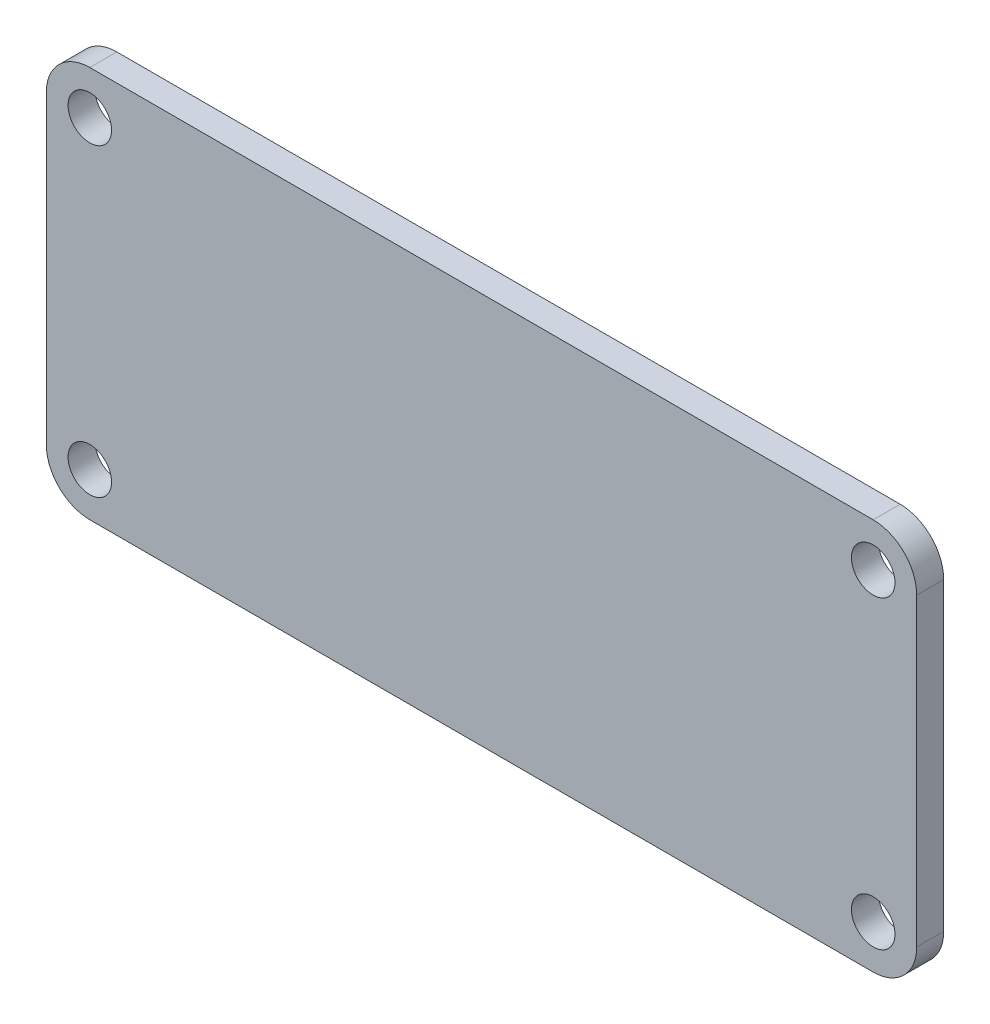
ISO-10303-21;
HEADER;
FILE_DESCRIPTION(('STEP AP214'),'2;1');
FILE_NAME('part.step','',(''),(''),'','','');
FILE_SCHEMA(('AUTOMOTIVE_DESIGN { 1 0 10303 214 1 1 1 1 }'));
ENDSEC;
DATA;
#1=APPLICATION_CONTEXT('core data for automotive mechanical design processes');
#2=APPLICATION_PROTOCOL_DEFINITION('international standard','automotive_design',2000,#1);
#3=PRODUCT_CONTEXT('',#1,'mechanical');
#4=PRODUCT('Part','Part','',(#3));
#5=PRODUCT_RELATED_PRODUCT_CATEGORY('part','',(#4));
#6=PRODUCT_DEFINITION_FORMATION('','',#4);
#7=PRODUCT_DEFINITION_CONTEXT('part definition',#1,'design');
#8=PRODUCT_DEFINITION('design','',#6,#7);
#9=PRODUCT_DEFINITION_SHAPE('','',#8);
#10=(LENGTH_UNIT() NAMED_UNIT(*) SI_UNIT(.MILLI.,.METRE.));
#11=(NAMED_UNIT(*) PLANE_ANGLE_UNIT() SI_UNIT($,.RADIAN.));
#12=(NAMED_UNIT(*) SI_UNIT($,.STERADIAN.) SOLID_ANGLE_UNIT());
#13=UNCERTAINTY_MEASURE_WITH_UNIT(LENGTH_MEASURE(1.E-05),#10,'distance_accuracy_value','');
#14=(GEOMETRIC_REPRESENTATION_CONTEXT(3) GLOBAL_UNCERTAINTY_ASSIGNED_CONTEXT((#13)) GLOBAL_UNIT_ASSIGNED_CONTEXT((#10,
#11,#12)) REPRESENTATION_CONTEXT('',''));
#15=CARTESIAN_POINT('',(0.,0.,0.));
#16=DIRECTION('',(0.,0.,1.));
#17=DIRECTION('',(1.,0.,0.));
#18=AXIS2_PLACEMENT_3D('',#15,#16,#17);
#19=CARTESIAN_POINT('',(-25.4,-11.43,1.5748));
#20=DIRECTION('',(1.,0.,0.));
#21=DIRECTION('',(0.,0.,-1.));
#22=AXIS2_PLACEMENT_3D('',#19,#20,#21);
#23=PLANE('',#22);
#24=DIRECTION('',(0.,-1.,0.));
#25=VECTOR('',#24,1.);
#26=CARTESIAN_POINT('',(-25.4,-11.43,0.));
#27=LINE('',#26,#25);
#28=CARTESIAN_POINT('',(-25.4,8.89,0.));
#29=VERTEX_POINT('',#28);
#30=CARTESIAN_POINT('',(-25.4,-8.89,0.));
#31=VERTEX_POINT('',#30);
#32=EDGE_CURVE('E158',#29,#31,#27,.T.);
#33=ORIENTED_EDGE('',*,*,#32,.T.);
#34=DIRECTION('',(0.,0.,-1.));
#35=VECTOR('',#34,1.);
#36=CARTESIAN_POINT('',(-25.4,-8.89,1.5748));
#37=LINE('',#36,#35);
#38=CARTESIAN_POINT('',(-25.4,-8.89,1.5748));
#39=VERTEX_POINT('',#38);
#40=EDGE_CURVE('E11',#31,#39,#37,.F.);
#41=ORIENTED_EDGE('',*,*,#40,.T.);
#42=DIRECTION('',(0.,-1.,0.));
#43=VECTOR('',#42,1.);
#44=CARTESIAN_POINT('',(-25.4,-11.43,1.5748));
#45=LINE('',#44,#43);
#46=CARTESIAN_POINT('',(-25.4,8.89,1.5748));
#47=VERTEX_POINT('',#46);
#48=EDGE_CURVE('E126',#47,#39,#45,.T.);
#49=ORIENTED_EDGE('',*,*,#48,.F.);
#50=DIRECTION('',(0.,0.,-1.));
#51=VECTOR('',#50,1.);
#52=CARTESIAN_POINT('',(-25.4,8.89,1.5748));
#53=LINE('',#52,#51);
#54=EDGE_CURVE('E42',#47,#29,#53,.T.);
#55=ORIENTED_EDGE('',*,*,#54,.T.);
#56=EDGE_LOOP('',(#33,#41,#49,#55));
#57=FACE_BOUND('',#56,.T.);
#58=ADVANCED_FACE('F34',(#57),#23,.F.);
#59=CARTESIAN_POINT('',(25.4,-11.43,1.5748));
#60=DIRECTION('',(0.,1.,0.));
#61=DIRECTION('',(-1.,0.,0.));
#62=AXIS2_PLACEMENT_3D('',#59,#60,#61);
#63=PLANE('',#62);
#64=DIRECTION('',(1.,0.,0.));
#65=VECTOR('',#64,1.);
#66=CARTESIAN_POINT('',(25.4,-11.43,0.));
#67=LINE('',#66,#65);
#68=CARTESIAN_POINT('',(-22.86,-11.43,0.));
#69=VERTEX_POINT('',#68);
#70=CARTESIAN_POINT('',(22.86,-11.43,0.));
#71=VERTEX_POINT('',#70);
#72=EDGE_CURVE('E131',#69,#71,#67,.T.);
#73=ORIENTED_EDGE('',*,*,#72,.T.);
#74=DIRECTION('',(0.,0.,-1.));
#75=VECTOR('',#74,1.);
#76=CARTESIAN_POINT('',(22.86,-11.43,1.5748));
#77=LINE('',#76,#75);
#78=CARTESIAN_POINT('',(22.86,-11.43,1.5748));
#79=VERTEX_POINT('',#78);
#80=EDGE_CURVE('E49',#71,#79,#77,.F.);
#81=ORIENTED_EDGE('',*,*,#80,.T.);
#82=DIRECTION('',(1.,0.,0.));
#83=VECTOR('',#82,1.);
#84=CARTESIAN_POINT('',(25.4,-11.43,1.5748));
#85=LINE('',#84,#83);
#86=CARTESIAN_POINT('',(-22.86,-11.43,1.5748));
#87=VERTEX_POINT('',#86);
#88=EDGE_CURVE('E129',#87,#79,#85,.T.);
#89=ORIENTED_EDGE('',*,*,#88,.F.);
#90=DIRECTION('',(0.,0.,-1.));
#91=VECTOR('',#90,1.);
#92=CARTESIAN_POINT('',(-22.86,-11.43,1.5748));
#93=LINE('',#92,#91);
#94=EDGE_CURVE('E150',#87,#69,#93,.T.);
#95=ORIENTED_EDGE('',*,*,#94,.T.);
#96=EDGE_LOOP('',(#73,#81,#89,#95));
#97=FACE_BOUND('',#96,.T.);
#98=ADVANCED_FACE('F218',(#97),#63,.F.);
#99=CARTESIAN_POINT('',(25.4,-11.43,1.5748));
#100=DIRECTION('',(-1.,0.,0.));
#101=DIRECTION('',(0.,0.,1.));
#102=AXIS2_PLACEMENT_3D('',#99,#100,#101);
#103=PLANE('',#102);
#104=DIRECTION('',(0.,1.,0.));
#105=VECTOR('',#104,1.);
#106=CARTESIAN_POINT('',(25.4,-11.43,0.));
#107=LINE('',#106,#105);
#108=CARTESIAN_POINT('',(25.4,-8.89,0.));
#109=VERTEX_POINT('',#108);
#110=CARTESIAN_POINT('',(25.4,8.89,0.));
#111=VERTEX_POINT('',#110);
#112=EDGE_CURVE('E127',#109,#111,#107,.T.);
#113=ORIENTED_EDGE('',*,*,#112,.T.);
#114=DIRECTION('',(0.,0.,-1.));
#115=VECTOR('',#114,1.);
#116=CARTESIAN_POINT('',(25.4,8.89,1.5748));
#117=LINE('',#116,#115);
#118=CARTESIAN_POINT('',(25.4,8.89,1.5748));
#119=VERTEX_POINT('',#118);
#120=EDGE_CURVE('E105',#111,#119,#117,.F.);
#121=ORIENTED_EDGE('',*,*,#120,.T.);
#122=DIRECTION('',(0.,1.,0.));
#123=VECTOR('',#122,1.);
#124=CARTESIAN_POINT('',(25.4,-11.43,1.5748));
#125=LINE('',#124,#123);
#126=CARTESIAN_POINT('',(25.4,-8.89,1.5748));
#127=VERTEX_POINT('',#126);
#128=EDGE_CURVE('E170',#127,#119,#125,.T.);
#129=ORIENTED_EDGE('',*,*,#128,.F.);
#130=DIRECTION('',(0.,0.,-1.));
#131=VECTOR('',#130,1.);
#132=CARTESIAN_POINT('',(25.4,-8.89,1.5748));
#133=LINE('',#132,#131);
#134=EDGE_CURVE('E110',#127,#109,#133,.T.);
#135=ORIENTED_EDGE('',*,*,#134,.T.);
#136=EDGE_LOOP('',(#113,#121,#129,#135));
#137=FACE_BOUND('',#136,.T.);
#138=ADVANCED_FACE('F215',(#137),#103,.F.);
#139=CARTESIAN_POINT('',(25.4,11.43,1.5748));
#140=DIRECTION('',(0.,-1.,0.));
#141=DIRECTION('',(1.,0.,0.));
#142=AXIS2_PLACEMENT_3D('',#139,#140,#141);
#143=PLANE('',#142);
#144=DIRECTION('',(-1.,0.,0.));
#145=VECTOR('',#144,1.);
#146=CARTESIAN_POINT('',(25.4,11.43,1.5748));
#147=LINE('',#146,#145);
#148=CARTESIAN_POINT('',(22.86,11.43,1.5748));
#149=VERTEX_POINT('',#148);
#150=CARTESIAN_POINT('',(-22.86,11.43,1.5748));
#151=VERTEX_POINT('',#150);
#152=EDGE_CURVE('E120',#149,#151,#147,.T.);
#153=ORIENTED_EDGE('',*,*,#152,.F.);
#154=DIRECTION('',(0.,0.,-1.));
#155=VECTOR('',#154,1.);
#156=CARTESIAN_POINT('',(22.86,11.43,1.5748));
#157=LINE('',#156,#155);
#158=CARTESIAN_POINT('',(22.86,11.43,0.));
#159=VERTEX_POINT('',#158);
#160=EDGE_CURVE('E104',#149,#159,#157,.T.);
#161=ORIENTED_EDGE('',*,*,#160,.T.);
#162=DIRECTION('',(-1.,0.,0.));
#163=VECTOR('',#162,1.);
#164=CARTESIAN_POINT('',(25.4,11.43,0.));
#165=LINE('',#164,#163);
#166=CARTESIAN_POINT('',(-22.86,11.43,0.));
#167=VERTEX_POINT('',#166);
#168=EDGE_CURVE('E117',#159,#167,#165,.T.);
#169=ORIENTED_EDGE('',*,*,#168,.T.);
#170=DIRECTION('',(0.,0.,-1.));
#171=VECTOR('',#170,1.);
#172=CARTESIAN_POINT('',(-22.86,11.43,1.5748));
#173=LINE('',#172,#171);
#174=EDGE_CURVE('E122',#167,#151,#173,.F.);
#175=ORIENTED_EDGE('',*,*,#174,.T.);
#176=EDGE_LOOP('',(#153,#161,#169,#175));
#177=FACE_BOUND('',#176,.T.);
#178=ADVANCED_FACE('F116',(#177),#143,.F.);
#179=CARTESIAN_POINT('',(0.,0.,1.5748));
#180=DIRECTION('',(0.,0.,1.));
#181=DIRECTION('',(1.,0.,0.));
#182=AXIS2_PLACEMENT_3D('',#179,#180,#181);
#183=PLANE('',#182);
#184=CARTESIAN_POINT('',(22.86,8.89,1.5748));
#185=DIRECTION('',(0.,0.,1.));
#186=DIRECTION('',(1.,0.,0.));
#187=AXIS2_PLACEMENT_3D('',#184,#185,#186);
#188=CIRCLE('',#187,1.27);
#189=CARTESIAN_POINT('',(24.13,8.89,1.5748));
#190=VERTEX_POINT('',#189);
#191=EDGE_CURVE('E184',#190,#190,#188,.T.);
#192=ORIENTED_EDGE('',*,*,#191,.F.);
#193=EDGE_LOOP('',(#192));
#194=FACE_BOUND('',#193,.T.);
#195=CARTESIAN_POINT('',(-22.86,-8.89,1.5748));
#196=DIRECTION('',(0.,0.,1.));
#197=DIRECTION('',(1.,0.,0.));
#198=AXIS2_PLACEMENT_3D('',#195,#196,#197);
#199=CIRCLE('',#198,1.27);
#200=CARTESIAN_POINT('',(-21.59,-8.89,1.5748));
#201=VERTEX_POINT('',#200);
#202=EDGE_CURVE('E177',#201,#201,#199,.T.);
#203=ORIENTED_EDGE('',*,*,#202,.F.);
#204=EDGE_LOOP('',(#203));
#205=FACE_BOUND('',#204,.T.);
#206=CARTESIAN_POINT('',(22.86,-8.89,1.5748));
#207=DIRECTION('',(0.,0.,1.));
#208=DIRECTION('',(1.,0.,0.));
#209=AXIS2_PLACEMENT_3D('',#206,#207,#208);
#210=CIRCLE('',#209,1.27);
#211=CARTESIAN_POINT('',(24.13,-8.89,1.5748));
#212=VERTEX_POINT('',#211);
#213=EDGE_CURVE('E189',#212,#212,#210,.T.);
#214=ORIENTED_EDGE('',*,*,#213,.F.);
#215=EDGE_LOOP('',(#214));
#216=FACE_BOUND('',#215,.T.);
#217=CARTESIAN_POINT('',(-22.86,8.89,1.5748));
#218=DIRECTION('',(0.,0.,1.));
#219=DIRECTION('',(1.,0.,0.));
#220=AXIS2_PLACEMENT_3D('',#217,#218,#219);
#221=CIRCLE('',#220,1.27);
#222=CARTESIAN_POINT('',(-21.59,8.89,1.5748));
#223=VERTEX_POINT('',#222);
#224=EDGE_CURVE('E166',#223,#223,#221,.T.);
#225=ORIENTED_EDGE('',*,*,#224,.F.);
#226=EDGE_LOOP('',(#225));
#227=FACE_BOUND('',#226,.T.);
#228=ORIENTED_EDGE('',*,*,#128,.T.);
#229=CARTESIAN_POINT('',(22.86,8.89,1.5748));
#230=DIRECTION('',(0.,0.,1.));
#231=DIRECTION('',(1.,0.,0.));
#232=AXIS2_PLACEMENT_3D('',#229,#230,#231);
#233=CIRCLE('',#232,2.54);
#234=EDGE_CURVE('E148',#119,#149,#233,.T.);
#235=ORIENTED_EDGE('',*,*,#234,.T.);
#236=ORIENTED_EDGE('',*,*,#152,.T.);
#237=CARTESIAN_POINT('',(-22.86,8.89,1.5748));
#238=DIRECTION('',(0.,0.,1.));
#239=DIRECTION('',(1.,0.,0.));
#240=AXIS2_PLACEMENT_3D('',#237,#238,#239);
#241=CIRCLE('',#240,2.54);
#242=EDGE_CURVE('E143',#151,#47,#241,.T.);
#243=ORIENTED_EDGE('',*,*,#242,.T.);
#244=ORIENTED_EDGE('',*,*,#48,.T.);
#245=CARTESIAN_POINT('',(-22.86,-8.89,1.5748));
#246=DIRECTION('',(0.,0.,1.));
#247=DIRECTION('',(1.,0.,0.));
#248=AXIS2_PLACEMENT_3D('',#245,#246,#247);
#249=CIRCLE('',#248,2.54);
#250=EDGE_CURVE('E56',#39,#87,#249,.T.);
#251=ORIENTED_EDGE('',*,*,#250,.T.);
#252=ORIENTED_EDGE('',*,*,#88,.T.);
#253=CARTESIAN_POINT('',(22.86,-8.89,1.5748));
#254=DIRECTION('',(0.,0.,1.));
#255=DIRECTION('',(1.,0.,0.));
#256=AXIS2_PLACEMENT_3D('',#253,#254,#255);
#257=CIRCLE('',#256,2.54);
#258=EDGE_CURVE('E146',#79,#127,#257,.T.);
#259=ORIENTED_EDGE('',*,*,#258,.T.);
#260=EDGE_LOOP('',(#228,#235,#236,#243,#244,#251,#252,#259));
#261=FACE_BOUND('',#260,.T.);
#262=ADVANCED_FACE('F205',(#194,#205,#216,#227,#261),#183,.T.);
#263=CARTESIAN_POINT('',(0.,0.,0.));
#264=DIRECTION('',(0.,0.,1.));
#265=DIRECTION('',(1.,0.,0.));
#266=AXIS2_PLACEMENT_3D('',#263,#264,#265);
#267=PLANE('',#266);
#268=CARTESIAN_POINT('',(22.86,8.89,0.));
#269=DIRECTION('',(0.,0.,1.));
#270=DIRECTION('',(1.,0.,0.));
#271=AXIS2_PLACEMENT_3D('',#268,#269,#270);
#272=CIRCLE('',#271,1.27);
#273=CARTESIAN_POINT('',(24.13,8.89,0.));
#274=VERTEX_POINT('',#273);
#275=EDGE_CURVE('E175',#274,#274,#272,.T.);
#276=ORIENTED_EDGE('',*,*,#275,.T.);
#277=EDGE_LOOP('',(#276));
#278=FACE_BOUND('',#277,.T.);
#279=CARTESIAN_POINT('',(-22.86,-8.89,0.));
#280=DIRECTION('',(0.,0.,1.));
#281=DIRECTION('',(1.,0.,0.));
#282=AXIS2_PLACEMENT_3D('',#279,#280,#281);
#283=CIRCLE('',#282,1.27);
#284=CARTESIAN_POINT('',(-21.59,-8.89,0.));
#285=VERTEX_POINT('',#284);
#286=EDGE_CURVE('E180',#285,#285,#283,.T.);
#287=ORIENTED_EDGE('',*,*,#286,.T.);
#288=EDGE_LOOP('',(#287));
#289=FACE_BOUND('',#288,.T.);
#290=CARTESIAN_POINT('',(22.86,-8.89,0.));
#291=DIRECTION('',(0.,0.,1.));
#292=DIRECTION('',(1.,0.,0.));
#293=AXIS2_PLACEMENT_3D('',#290,#291,#292);
#294=CIRCLE('',#293,1.27);
#295=CARTESIAN_POINT('',(24.13,-8.89,0.));
#296=VERTEX_POINT('',#295);
#297=EDGE_CURVE('E181',#296,#296,#294,.T.);
#298=ORIENTED_EDGE('',*,*,#297,.T.);
#299=EDGE_LOOP('',(#298));
#300=FACE_BOUND('',#299,.T.);
#301=CARTESIAN_POINT('',(-22.86,8.89,0.));
#302=DIRECTION('',(0.,0.,1.));
#303=DIRECTION('',(1.,0.,0.));
#304=AXIS2_PLACEMENT_3D('',#301,#302,#303);
#305=CIRCLE('',#304,1.27);
#306=CARTESIAN_POINT('',(-21.59,8.89,0.));
#307=VERTEX_POINT('',#306);
#308=EDGE_CURVE('E163',#307,#307,#305,.T.);
#309=ORIENTED_EDGE('',*,*,#308,.T.);
#310=EDGE_LOOP('',(#309));
#311=FACE_BOUND('',#310,.T.);
#312=ORIENTED_EDGE('',*,*,#168,.F.);
#313=CARTESIAN_POINT('',(22.86,8.89,0.));
#314=DIRECTION('',(0.,0.,1.));
#315=DIRECTION('',(1.,0.,0.));
#316=AXIS2_PLACEMENT_3D('',#313,#314,#315);
#317=CIRCLE('',#316,2.54);
#318=EDGE_CURVE('E100',#159,#111,#317,.F.);
#319=ORIENTED_EDGE('',*,*,#318,.T.);
#320=ORIENTED_EDGE('',*,*,#112,.F.);
#321=CARTESIAN_POINT('',(22.86,-8.89,0.));
#322=DIRECTION('',(0.,0.,1.));
#323=DIRECTION('',(1.,0.,0.));
#324=AXIS2_PLACEMENT_3D('',#321,#322,#323);
#325=CIRCLE('',#324,2.54);
#326=EDGE_CURVE('E111',#109,#71,#325,.F.);
#327=ORIENTED_EDGE('',*,*,#326,.T.);
#328=ORIENTED_EDGE('',*,*,#72,.F.);
#329=CARTESIAN_POINT('',(-22.86,-8.89,0.));
#330=DIRECTION('',(0.,0.,1.));
#331=DIRECTION('',(1.,0.,0.));
#332=AXIS2_PLACEMENT_3D('',#329,#330,#331);
#333=CIRCLE('',#332,2.54);
#334=EDGE_CURVE('E137',#69,#31,#333,.F.);
#335=ORIENTED_EDGE('',*,*,#334,.T.);
#336=ORIENTED_EDGE('',*,*,#32,.F.);
#337=CARTESIAN_POINT('',(-22.86,8.89,0.));
#338=DIRECTION('',(0.,0.,1.));
#339=DIRECTION('',(1.,0.,0.));
#340=AXIS2_PLACEMENT_3D('',#337,#338,#339);
#341=CIRCLE('',#340,2.54);
#342=EDGE_CURVE('E121',#29,#167,#341,.F.);
#343=ORIENTED_EDGE('',*,*,#342,.T.);
#344=EDGE_LOOP('',(#312,#319,#320,#327,#328,#335,#336,#343));
#345=FACE_BOUND('',#344,.T.);
#346=ADVANCED_FACE('F124',(#278,#289,#300,#311,#345),#267,.F.);
#347=CARTESIAN_POINT('',(-22.86,8.89,0.));
#348=DIRECTION('',(0.,0.,1.));
#349=DIRECTION('',(1.,0.,0.));
#350=AXIS2_PLACEMENT_3D('',#347,#348,#349);
#351=CYLINDRICAL_SURFACE('',#350,1.27);
#352=ORIENTED_EDGE('',*,*,#308,.F.);
#353=EDGE_LOOP('',(#352));
#354=FACE_BOUND('',#353,.T.);
#355=ORIENTED_EDGE('',*,*,#224,.T.);
#356=EDGE_LOOP('',(#355));
#357=FACE_BOUND('',#356,.T.);
#358=ADVANCED_FACE('F201',(#354,#357),#351,.F.);
#359=CARTESIAN_POINT('',(22.86,-8.89,0.));
#360=DIRECTION('',(0.,0.,1.));
#361=DIRECTION('',(1.,0.,0.));
#362=AXIS2_PLACEMENT_3D('',#359,#360,#361);
#363=CYLINDRICAL_SURFACE('',#362,1.27);
#364=ORIENTED_EDGE('',*,*,#297,.F.);
#365=EDGE_LOOP('',(#364));
#366=FACE_BOUND('',#365,.T.);
#367=ORIENTED_EDGE('',*,*,#213,.T.);
#368=EDGE_LOOP('',(#367));
#369=FACE_BOUND('',#368,.T.);
#370=ADVANCED_FACE('F197',(#366,#369),#363,.F.);
#371=CARTESIAN_POINT('',(-22.86,-8.89,0.));
#372=DIRECTION('',(0.,0.,1.));
#373=DIRECTION('',(1.,0.,0.));
#374=AXIS2_PLACEMENT_3D('',#371,#372,#373);
#375=CYLINDRICAL_SURFACE('',#374,1.27);
#376=ORIENTED_EDGE('',*,*,#286,.F.);
#377=EDGE_LOOP('',(#376));
#378=FACE_BOUND('',#377,.T.);
#379=ORIENTED_EDGE('',*,*,#202,.T.);
#380=EDGE_LOOP('',(#379));
#381=FACE_BOUND('',#380,.T.);
#382=ADVANCED_FACE('F200',(#378,#381),#375,.F.);
#383=CARTESIAN_POINT('',(22.86,8.89,0.));
#384=DIRECTION('',(0.,0.,1.));
#385=DIRECTION('',(1.,0.,0.));
#386=AXIS2_PLACEMENT_3D('',#383,#384,#385);
#387=CYLINDRICAL_SURFACE('',#386,1.27);
#388=ORIENTED_EDGE('',*,*,#275,.F.);
#389=EDGE_LOOP('',(#388));
#390=FACE_BOUND('',#389,.T.);
#391=ORIENTED_EDGE('',*,*,#191,.T.);
#392=EDGE_LOOP('',(#391));
#393=FACE_BOUND('',#392,.T.);
#394=ADVANCED_FACE('F236',(#390,#393),#387,.F.);
#395=CARTESIAN_POINT('',(22.86,8.89,1.5748));
#396=DIRECTION('',(0.,0.,-1.));
#397=DIRECTION('',(-1.,0.,0.));
#398=AXIS2_PLACEMENT_3D('',#395,#396,#397);
#399=CYLINDRICAL_SURFACE('',#398,2.54);
#400=ORIENTED_EDGE('',*,*,#234,.F.);
#401=ORIENTED_EDGE('',*,*,#120,.F.);
#402=ORIENTED_EDGE('',*,*,#318,.F.);
#403=ORIENTED_EDGE('',*,*,#160,.F.);
#404=EDGE_LOOP('',(#400,#401,#402,#403));
#405=FACE_BOUND('',#404,.T.);
#406=ADVANCED_FACE('F103',(#405),#399,.T.);
#407=CARTESIAN_POINT('',(22.86,-8.89,1.5748));
#408=DIRECTION('',(0.,0.,-1.));
#409=DIRECTION('',(-1.,0.,0.));
#410=AXIS2_PLACEMENT_3D('',#407,#408,#409);
#411=CYLINDRICAL_SURFACE('',#410,2.54);
#412=ORIENTED_EDGE('',*,*,#258,.F.);
#413=ORIENTED_EDGE('',*,*,#80,.F.);
#414=ORIENTED_EDGE('',*,*,#326,.F.);
#415=ORIENTED_EDGE('',*,*,#134,.F.);
#416=EDGE_LOOP('',(#412,#413,#414,#415));
#417=FACE_BOUND('',#416,.T.);
#418=ADVANCED_FACE('F217',(#417),#411,.T.);
#419=CARTESIAN_POINT('',(-22.86,-8.89,1.5748));
#420=DIRECTION('',(0.,0.,-1.));
#421=DIRECTION('',(-1.,0.,0.));
#422=AXIS2_PLACEMENT_3D('',#419,#420,#421);
#423=CYLINDRICAL_SURFACE('',#422,2.54);
#424=ORIENTED_EDGE('',*,*,#250,.F.);
#425=ORIENTED_EDGE('',*,*,#40,.F.);
#426=ORIENTED_EDGE('',*,*,#334,.F.);
#427=ORIENTED_EDGE('',*,*,#94,.F.);
#428=EDGE_LOOP('',(#424,#425,#426,#427));
#429=FACE_BOUND('',#428,.T.);
#430=ADVANCED_FACE('F221',(#429),#423,.T.);
#431=CARTESIAN_POINT('',(-22.86,8.89,1.5748));
#432=DIRECTION('',(0.,0.,-1.));
#433=DIRECTION('',(-1.,0.,0.));
#434=AXIS2_PLACEMENT_3D('',#431,#432,#433);
#435=CYLINDRICAL_SURFACE('',#434,2.54);
#436=ORIENTED_EDGE('',*,*,#242,.F.);
#437=ORIENTED_EDGE('',*,*,#174,.F.);
#438=ORIENTED_EDGE('',*,*,#342,.F.);
#439=ORIENTED_EDGE('',*,*,#54,.F.);
#440=EDGE_LOOP('',(#436,#437,#438,#439));
#441=FACE_BOUND('',#440,.T.);
#442=ADVANCED_FACE('F36',(#441),#435,.T.);
#443=CLOSED_SHELL('',(#58,#98,#138,#178,#262,#346,#358,#370,#382,#394,#406,#418,#430,#442));
#444=MANIFOLD_SOLID_BREP('B2',#443);
#445=ADVANCED_BREP_SHAPE_REPRESENTATION('',(#18,#444),#14);
#446=SHAPE_DEFINITION_REPRESENTATION(#9,#445);
ENDSEC;
END-ISO-10303-21;
